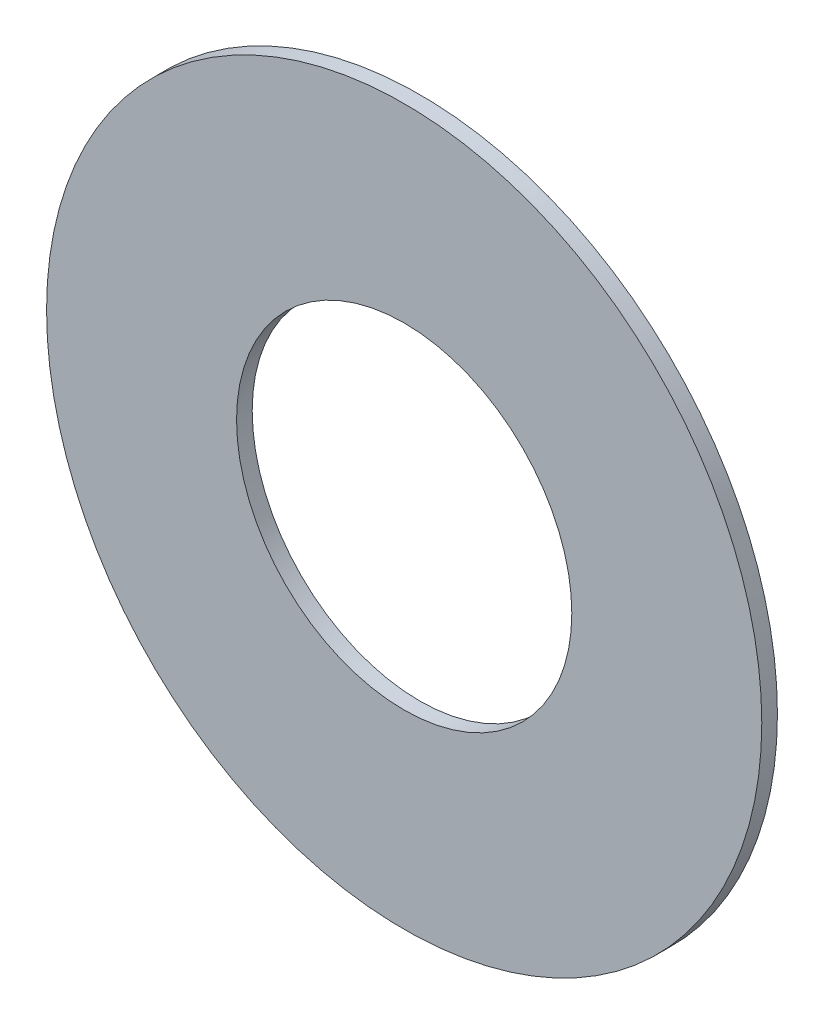
ISO-10303-21;
HEADER;
FILE_DESCRIPTION(('STEP AP214'),'2;1');
FILE_NAME('part.step','',(''),(''),'','','');
FILE_SCHEMA(('AUTOMOTIVE_DESIGN { 1 0 10303 214 1 1 1 1 }'));
ENDSEC;
DATA;
#1=APPLICATION_CONTEXT('core data for automotive mechanical design processes');
#2=APPLICATION_PROTOCOL_DEFINITION('international standard','automotive_design',2000,#1);
#3=PRODUCT_CONTEXT('',#1,'mechanical');
#4=PRODUCT('Part','Part','',(#3));
#5=PRODUCT_RELATED_PRODUCT_CATEGORY('part','',(#4));
#6=PRODUCT_DEFINITION_FORMATION('','',#4);
#7=PRODUCT_DEFINITION_CONTEXT('part definition',#1,'design');
#8=PRODUCT_DEFINITION('design','',#6,#7);
#9=PRODUCT_DEFINITION_SHAPE('','',#8);
#10=(LENGTH_UNIT() NAMED_UNIT(*) SI_UNIT(.MILLI.,.METRE.));
#11=(NAMED_UNIT(*) PLANE_ANGLE_UNIT() SI_UNIT($,.RADIAN.));
#12=(NAMED_UNIT(*) SI_UNIT($,.STERADIAN.) SOLID_ANGLE_UNIT());
#13=UNCERTAINTY_MEASURE_WITH_UNIT(LENGTH_MEASURE(1.E-05),#10,'distance_accuracy_value','');
#14=(GEOMETRIC_REPRESENTATION_CONTEXT(3) GLOBAL_UNCERTAINTY_ASSIGNED_CONTEXT((#13)) GLOBAL_UNIT_ASSIGNED_CONTEXT((#10,
#11,#12)) REPRESENTATION_CONTEXT('',''));
#15=CARTESIAN_POINT('',(0.,0.,0.));
#16=DIRECTION('',(0.,0.,1.));
#17=DIRECTION('',(1.,0.,0.));
#18=AXIS2_PLACEMENT_3D('',#15,#16,#17);
#19=CARTESIAN_POINT('',(155.448,-72.644,-0.045));
#20=DIRECTION('',(0.,0.,-1.));
#21=DIRECTION('',(0.,-1.,0.));
#22=AXIS2_PLACEMENT_3D('',#19,#20,#21);
#23=CYLINDRICAL_SURFACE('',#22,0.375);
#24=CARTESIAN_POINT('',(155.448,-72.644,-0.035));
#25=DIRECTION('',(0.,0.,-1.));
#26=DIRECTION('',(0.,-1.,0.));
#27=AXIS2_PLACEMENT_3D('',#24,#25,#26);
#28=CIRCLE('',#27,0.375);
#29=CARTESIAN_POINT('',(155.448,-73.019,-0.035));
#30=VERTEX_POINT('',#29);
#31=EDGE_CURVE('E20',#30,#30,#28,.T.);
#32=ORIENTED_EDGE('',*,*,#31,.T.);
#33=DIRECTION('',(0.,0.,1.));
#34=VECTOR('',#33,1.);
#35=CARTESIAN_POINT('',(155.448,-73.019,-0.045));
#36=LINE('',#35,#34);
#37=CARTESIAN_POINT('',(155.448,-73.019,0.));
#38=VERTEX_POINT('',#37);
#39=EDGE_CURVE('E11',#30,#38,#36,.T.);
#40=ORIENTED_EDGE('',*,*,#39,.T.);
#41=CARTESIAN_POINT('',(155.448,-72.644,0.));
#42=DIRECTION('',(0.,0.,-1.));
#43=DIRECTION('',(0.,-1.,0.));
#44=AXIS2_PLACEMENT_3D('',#41,#42,#43);
#45=CIRCLE('',#44,0.375);
#46=EDGE_CURVE('E69',#38,#38,#45,.T.);
#47=ORIENTED_EDGE('',*,*,#46,.F.);
#48=ORIENTED_EDGE('',*,*,#39,.F.);
#49=EDGE_LOOP('',(#32,#40,#47,#48));
#50=FACE_BOUND('',#49,.T.);
#51=ADVANCED_FACE('F17',(#50),#23,.F.);
#52=CARTESIAN_POINT('',(155.448,-72.644,-0.035));
#53=DIRECTION('',(0.,0.,1.));
#54=DIRECTION('',(1.,0.,0.));
#55=AXIS2_PLACEMENT_3D('',#52,#53,#54);
#56=PLANE('',#55);
#57=ORIENTED_EDGE('',*,*,#31,.F.);
#58=EDGE_LOOP('',(#57));
#59=FACE_BOUND('',#58,.T.);
#60=CARTESIAN_POINT('',(155.448,-72.644,-0.035));
#61=DIRECTION('',(0.,0.,1.));
#62=DIRECTION('',(1.,0.,0.));
#63=AXIS2_PLACEMENT_3D('',#60,#61,#62);
#64=CIRCLE('',#63,0.8);
#65=CARTESIAN_POINT('',(156.248,-72.644,-0.035));
#66=VERTEX_POINT('',#65);
#67=EDGE_CURVE('E57',#66,#66,#64,.T.);
#68=ORIENTED_EDGE('',*,*,#67,.F.);
#69=EDGE_LOOP('',(#68));
#70=FACE_BOUND('',#69,.T.);
#71=ADVANCED_FACE('F79',(#59,#70),#56,.F.);
#72=CARTESIAN_POINT('',(155.448,-72.644,0.));
#73=DIRECTION('',(0.,0.,1.));
#74=DIRECTION('',(1.,0.,0.));
#75=AXIS2_PLACEMENT_3D('',#72,#73,#74);
#76=PLANE('',#75);
#77=ORIENTED_EDGE('',*,*,#46,.T.);
#78=EDGE_LOOP('',(#77));
#79=FACE_BOUND('',#78,.T.);
#80=CARTESIAN_POINT('',(155.448,-72.644,0.));
#81=DIRECTION('',(0.,0.,1.));
#82=DIRECTION('',(1.,0.,0.));
#83=AXIS2_PLACEMENT_3D('',#80,#81,#82);
#84=CIRCLE('',#83,0.8);
#85=CARTESIAN_POINT('',(156.248,-72.644,0.));
#86=VERTEX_POINT('',#85);
#87=EDGE_CURVE('E55',#86,#86,#84,.T.);
#88=ORIENTED_EDGE('',*,*,#87,.T.);
#89=EDGE_LOOP('',(#88));
#90=FACE_BOUND('',#89,.T.);
#91=ADVANCED_FACE('F61',(#79,#90),#76,.T.);
#92=CARTESIAN_POINT('',(155.448,-72.644,-0.035));
#93=DIRECTION('',(0.,0.,1.));
#94=DIRECTION('',(1.,0.,0.));
#95=AXIS2_PLACEMENT_3D('',#92,#93,#94);
#96=CYLINDRICAL_SURFACE('',#95,0.8);
#97=ORIENTED_EDGE('',*,*,#87,.F.);
#98=DIRECTION('',(0.,0.,1.));
#99=VECTOR('',#98,1.);
#100=CARTESIAN_POINT('',(156.248,-72.644,-0.035));
#101=LINE('',#100,#99);
#102=EDGE_CURVE('E52',#66,#86,#101,.T.);
#103=ORIENTED_EDGE('',*,*,#102,.F.);
#104=ORIENTED_EDGE('',*,*,#67,.T.);
#105=ORIENTED_EDGE('',*,*,#102,.T.);
#106=EDGE_LOOP('',(#97,#103,#104,#105));
#107=FACE_BOUND('',#106,.T.);
#108=ADVANCED_FACE('F54',(#107),#96,.T.);
#109=CLOSED_SHELL('',(#51,#71,#91,#108));
#110=MANIFOLD_SOLID_BREP('B1',#109);
#111=ADVANCED_BREP_SHAPE_REPRESENTATION('',(#18,#110),#14);
#112=SHAPE_DEFINITION_REPRESENTATION(#9,#111);
ENDSEC;
END-ISO-10303-21;
